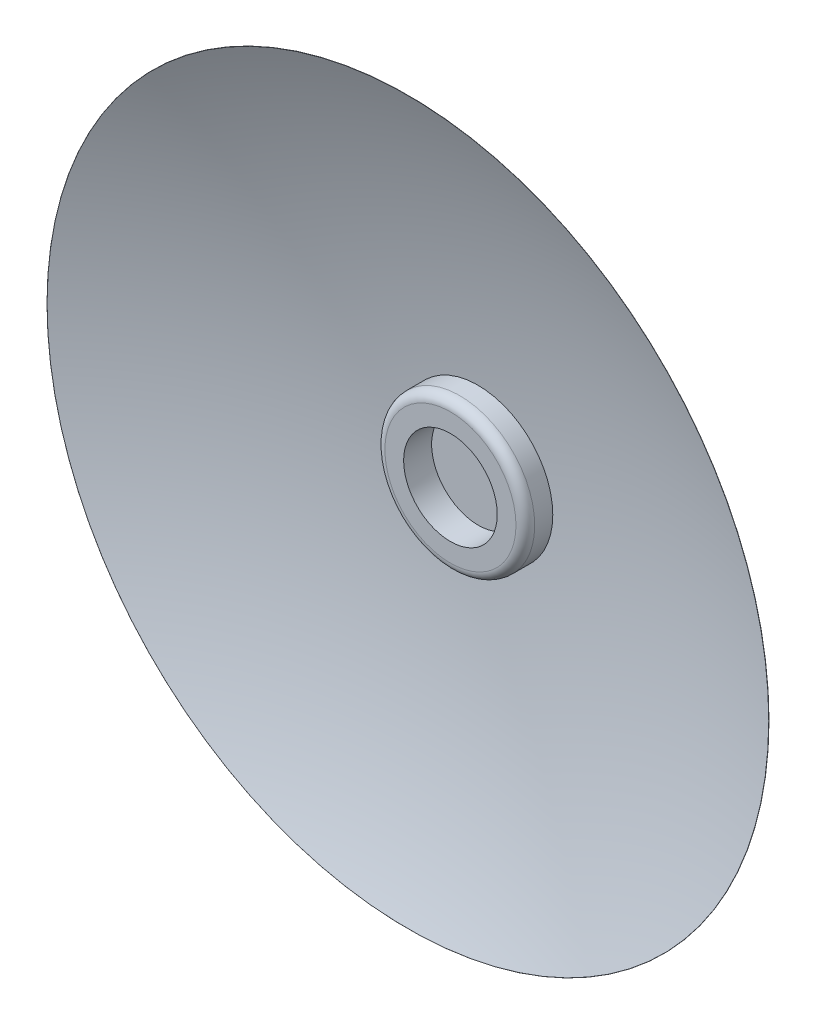
ISO-10303-21;
HEADER;
FILE_DESCRIPTION(('STEP AP214'),'2;1');
FILE_NAME('part.step','',(''),(''),'','','');
FILE_SCHEMA(('AUTOMOTIVE_DESIGN { 1 0 10303 214 1 1 1 1 }'));
ENDSEC;
DATA;
#1=APPLICATION_CONTEXT('core data for automotive mechanical design processes');
#2=APPLICATION_PROTOCOL_DEFINITION('international standard','automotive_design',2000,#1);
#3=PRODUCT_CONTEXT('',#1,'mechanical');
#4=PRODUCT('Part','Part','',(#3));
#5=PRODUCT_RELATED_PRODUCT_CATEGORY('part','',(#4));
#6=PRODUCT_DEFINITION_FORMATION('','',#4);
#7=PRODUCT_DEFINITION_CONTEXT('part definition',#1,'design');
#8=PRODUCT_DEFINITION('design','',#6,#7);
#9=PRODUCT_DEFINITION_SHAPE('','',#8);
#10=(LENGTH_UNIT() NAMED_UNIT(*) SI_UNIT(.MILLI.,.METRE.));
#11=(NAMED_UNIT(*) PLANE_ANGLE_UNIT() SI_UNIT($,.RADIAN.));
#12=(NAMED_UNIT(*) SI_UNIT($,.STERADIAN.) SOLID_ANGLE_UNIT());
#13=UNCERTAINTY_MEASURE_WITH_UNIT(LENGTH_MEASURE(1.E-05),#10,'distance_accuracy_value','');
#14=(GEOMETRIC_REPRESENTATION_CONTEXT(3) GLOBAL_UNCERTAINTY_ASSIGNED_CONTEXT((#13)) GLOBAL_UNIT_ASSIGNED_CONTEXT((#10,
#11,#12)) REPRESENTATION_CONTEXT('',''));
#15=CARTESIAN_POINT('',(0.,0.,0.));
#16=DIRECTION('',(0.,0.,1.));
#17=DIRECTION('',(1.,0.,0.));
#18=AXIS2_PLACEMENT_3D('',#15,#16,#17);
#19=CARTESIAN_POINT('',(0.,0.,-278.231194090801));
#20=DIRECTION('',(0.,0.,1.));
#21=DIRECTION('',(1.,0.,0.));
#22=AXIS2_PLACEMENT_3D('',#19,#20,#21);
#23=CYLINDRICAL_SURFACE('',#22,16.);
#24=CARTESIAN_POINT('',(0.,0.,-348.85065549996));
#25=DIRECTION('',(0.,0.,1.));
#26=DIRECTION('',(1.,0.,0.));
#27=AXIS2_PLACEMENT_3D('',#24,#25,#26);
#28=CIRCLE('',#27,16.);
#29=CARTESIAN_POINT('',(16.,0.,-348.85065549996));
#30=VERTEX_POINT('',#29);
#31=EDGE_CURVE('E50',#30,#30,#28,.T.);
#32=ORIENTED_EDGE('',*,*,#31,.F.);
#33=EDGE_LOOP('',(#32));
#34=FACE_BOUND('',#33,.T.);
#35=CARTESIAN_POINT('',(0.,0.,-352.714702608033));
#36=DIRECTION('',(0.,0.,1.));
#37=DIRECTION('',(1.,0.,0.));
#38=AXIS2_PLACEMENT_3D('',#35,#36,#37);
#39=CIRCLE('',#38,16.);
#40=CARTESIAN_POINT('',(16.,0.,-352.714702608033));
#41=VERTEX_POINT('',#40);
#42=EDGE_CURVE('E69',#41,#41,#39,.T.);
#43=ORIENTED_EDGE('',*,*,#42,.T.);
#44=EDGE_LOOP('',(#43));
#45=FACE_BOUND('',#44,.T.);
#46=ADVANCED_FACE('F41',(#34,#45),#23,.T.);
#47=CARTESIAN_POINT('',(0.,0.,-348.85065549996));
#48=DIRECTION('',(0.,0.,1.));
#49=DIRECTION('',(1.,0.,0.));
#50=AXIS2_PLACEMENT_3D('',#47,#48,#49);
#51=TOROIDAL_SURFACE('',#50,14.,2.);
#52=CARTESIAN_POINT('',(0.,0.,-346.850655499961));
#53=DIRECTION('',(0.,0.,1.));
#54=DIRECTION('',(1.,0.,0.));
#55=AXIS2_PLACEMENT_3D('',#52,#53,#54);
#56=CIRCLE('',#55,14.);
#57=CARTESIAN_POINT('',(14.,0.,-346.850655499961));
#58=VERTEX_POINT('',#57);
#59=EDGE_CURVE('E55',#58,#58,#56,.T.);
#60=ORIENTED_EDGE('',*,*,#59,.F.);
#61=EDGE_LOOP('',(#60));
#62=FACE_BOUND('',#61,.T.);
#63=ORIENTED_EDGE('',*,*,#31,.T.);
#64=EDGE_LOOP('',(#63));
#65=FACE_BOUND('',#64,.T.);
#66=ADVANCED_FACE('F111',(#62,#65),#51,.T.);
#67=CARTESIAN_POINT('',(0.,0.,-346.850655499961));
#68=DIRECTION('',(0.,0.,-1.));
#69=DIRECTION('',(-1.,0.,0.));
#70=AXIS2_PLACEMENT_3D('',#67,#68,#69);
#71=PLANE('',#70);
#72=CARTESIAN_POINT('',(0.,0.,-346.850655499961));
#73=DIRECTION('',(0.,0.,-1.));
#74=DIRECTION('',(-1.,0.,0.));
#75=AXIS2_PLACEMENT_3D('',#72,#73,#74);
#76=CIRCLE('',#75,10.);
#77=CARTESIAN_POINT('',(-10.,0.,-346.850655499961));
#78=VERTEX_POINT('',#77);
#79=EDGE_CURVE('E45',#78,#78,#76,.T.);
#80=ORIENTED_EDGE('',*,*,#79,.T.);
#81=EDGE_LOOP('',(#80));
#82=FACE_BOUND('',#81,.T.);
#83=ORIENTED_EDGE('',*,*,#59,.T.);
#84=EDGE_LOOP('',(#83));
#85=FACE_BOUND('',#84,.T.);
#86=ADVANCED_FACE('F94',(#82,#85),#71,.F.);
#87=CARTESIAN_POINT('',(0.,0.,-163.231194090801));
#88=DIRECTION('',(0.,0.,1.));
#89=DIRECTION('',(1.,0.,0.));
#90=AXIS2_PLACEMENT_3D('',#87,#88,#89);
#91=DEGENERATE_TOROIDAL_SURFACE('',#90,1.99999999999999,190.,.T.);
#92=CARTESIAN_POINT('',(0.,0.,-337.767251372358));
#93=DIRECTION('',(0.,0.,1.));
#94=DIRECTION('',(1.,0.,0.));
#95=AXIS2_PLACEMENT_3D('',#92,#93,#94);
#96=CIRCLE('',#95,77.0810542587733);
#97=CARTESIAN_POINT('',(77.0810542587733,0.,-337.767251372358));
#98=VERTEX_POINT('',#97);
#99=EDGE_CURVE('E81',#98,#98,#96,.T.);
#100=ORIENTED_EDGE('',*,*,#99,.T.);
#101=EDGE_LOOP('',(#100));
#102=FACE_BOUND('',#101,.T.);
#103=ORIENTED_EDGE('',*,*,#42,.F.);
#104=EDGE_LOOP('',(#103));
#105=FACE_BOUND('',#104,.T.);
#106=ADVANCED_FACE('F123',(#102,#105),#91,.F.);
#107=CARTESIAN_POINT('',(0.,0.,-278.231194090801));
#108=DIRECTION('',(0.,0.,1.));
#109=DIRECTION('',(1.,0.,0.));
#110=AXIS2_PLACEMENT_3D('',#107,#108,#109);
#111=CYLINDRICAL_SURFACE('',#110,7.);
#112=CARTESIAN_POINT('',(0.,0.,-354.759388720713));
#113=DIRECTION('',(0.,0.,1.));
#114=DIRECTION('',(1.,0.,0.));
#115=AXIS2_PLACEMENT_3D('',#112,#113,#114);
#116=CIRCLE('',#115,7.);
#117=CARTESIAN_POINT('',(6.99999999999999,0.,-354.759388720713));
#118=VERTEX_POINT('',#117);
#119=EDGE_CURVE('E73',#118,#118,#116,.T.);
#120=ORIENTED_EDGE('',*,*,#119,.F.);
#121=EDGE_LOOP('',(#120));
#122=FACE_BOUND('',#121,.T.);
#123=CARTESIAN_POINT('',(0.,0.,-353.165393223027));
#124=DIRECTION('',(0.,0.,1.));
#125=DIRECTION('',(1.,0.,0.));
#126=AXIS2_PLACEMENT_3D('',#123,#124,#125);
#127=CIRCLE('',#126,7.);
#128=CARTESIAN_POINT('',(6.99999999999999,0.,-353.165393223027));
#129=VERTEX_POINT('',#128);
#130=EDGE_CURVE('E10',#129,#129,#127,.T.);
#131=ORIENTED_EDGE('',*,*,#130,.T.);
#132=EDGE_LOOP('',(#131));
#133=FACE_BOUND('',#132,.T.);
#134=ADVANCED_FACE('F134',(#122,#133),#111,.F.);
#135=CARTESIAN_POINT('',(0.,0.,-180.713603855984));
#136=DIRECTION('',(0.,0.,1.));
#137=DIRECTION('',(1.,0.,0.));
#138=AXIS2_PLACEMENT_3D('',#135,#136,#137);
#139=DEGENERATE_TOROIDAL_SURFACE('',#138,1.99999999999999,174.117590234817,.T.);
#140=ORIENTED_EDGE('',*,*,#119,.T.);
#141=EDGE_LOOP('',(#140));
#142=FACE_BOUND('',#141,.T.);
#143=CARTESIAN_POINT('',(0.,0.,-337.803667723761));
#144=DIRECTION('',(0.,0.,1.));
#145=DIRECTION('',(1.,0.,0.));
#146=AXIS2_PLACEMENT_3D('',#143,#144,#145);
#147=CIRCLE('',#146,77.0975836042502);
#148=CARTESIAN_POINT('',(77.0975836042502,0.,-337.803667723761));
#149=VERTEX_POINT('',#148);
#150=EDGE_CURVE('E77',#149,#149,#147,.T.);
#151=ORIENTED_EDGE('',*,*,#150,.F.);
#152=EDGE_LOOP('',(#151));
#153=FACE_BOUND('',#152,.T.);
#154=ADVANCED_FACE('F138',(#142,#153),#139,.T.);
#155=CARTESIAN_POINT('',(0.,0.,-337.785623588914));
#156=DIRECTION('',(0.,0.,1.));
#157=DIRECTION('',(1.,0.,0.));
#158=AXIS2_PLACEMENT_3D('',#155,#156,#157);
#159=TOROIDAL_SURFACE('',#158,77.0889575276426,0.0199999999999912);
#160=ORIENTED_EDGE('',*,*,#150,.T.);
#161=EDGE_LOOP('',(#160));
#162=FACE_BOUND('',#161,.T.);
#163=ORIENTED_EDGE('',*,*,#99,.F.);
#164=EDGE_LOOP('',(#163));
#165=FACE_BOUND('',#164,.T.);
#166=ADVANCED_FACE('F127',(#162,#165),#159,.T.);
#167=CARTESIAN_POINT('',(0.,0.,-357.831194090801));
#168=DIRECTION('',(0.,0.,1.));
#169=DIRECTION('',(1.,0.,0.));
#170=AXIS2_PLACEMENT_3D('',#167,#168,#169);
#171=PLANE('',#170);
#172=CARTESIAN_POINT('',(0.,0.,-357.831194090801));
#173=DIRECTION('',(0.,0.,1.));
#174=DIRECTION('',(1.,0.,0.));
#175=AXIS2_PLACEMENT_3D('',#172,#173,#174);
#176=CIRCLE('',#175,1.99999999999999);
#177=CARTESIAN_POINT('',(1.99999999999998,0.,-357.831194090801));
#178=VERTEX_POINT('',#177);
#179=EDGE_CURVE('E61',#178,#178,#176,.T.);
#180=ORIENTED_EDGE('',*,*,#179,.F.);
#181=EDGE_LOOP('',(#180));
#182=FACE_BOUND('',#181,.T.);
#183=ADVANCED_FACE('F124',(#182),#171,.F.);
#184=CARTESIAN_POINT('',(0.,0.,-278.231194090801));
#185=DIRECTION('',(0.,0.,1.));
#186=DIRECTION('',(1.,0.,0.));
#187=AXIS2_PLACEMENT_3D('',#184,#185,#186);
#188=CYLINDRICAL_SURFACE('',#187,1.99999999999999);
#189=ORIENTED_EDGE('',*,*,#179,.T.);
#190=EDGE_LOOP('',(#189));
#191=FACE_BOUND('',#190,.T.);
#192=CARTESIAN_POINT('',(0.,0.,-353.231194090801));
#193=DIRECTION('',(0.,0.,1.));
#194=DIRECTION('',(1.,0.,0.));
#195=AXIS2_PLACEMENT_3D('',#192,#193,#194);
#196=CIRCLE('',#195,1.99999999999999);
#197=CARTESIAN_POINT('',(1.99999999999998,0.,-353.231194090801));
#198=VERTEX_POINT('',#197);
#199=EDGE_CURVE('E65',#198,#198,#196,.T.);
#200=ORIENTED_EDGE('',*,*,#199,.F.);
#201=EDGE_LOOP('',(#200));
#202=FACE_BOUND('',#201,.T.);
#203=ADVANCED_FACE('F107',(#191,#202),#188,.T.);
#204=CARTESIAN_POINT('',(0.,0.,-163.231194090801));
#205=DIRECTION('',(0.,0.,1.));
#206=DIRECTION('',(1.,0.,0.));
#207=AXIS2_PLACEMENT_3D('',#204,#205,#206);
#208=DEGENERATE_TOROIDAL_SURFACE('',#207,1.99999999999999,190.,.T.);
#209=ORIENTED_EDGE('',*,*,#199,.T.);
#210=EDGE_LOOP('',(#209));
#211=FACE_BOUND('',#210,.T.);
#212=ORIENTED_EDGE('',*,*,#130,.F.);
#213=EDGE_LOOP('',(#212));
#214=FACE_BOUND('',#213,.T.);
#215=ADVANCED_FACE('F43',(#211,#214),#208,.T.);
#216=CARTESIAN_POINT('',(0.,0.,-352.831194090801));
#217=DIRECTION('',(0.,0.,1.));
#218=DIRECTION('',(1.,0.,0.));
#219=AXIS2_PLACEMENT_3D('',#216,#217,#218);
#220=CYLINDRICAL_SURFACE('',#219,10.);
#221=CARTESIAN_POINT('',(0.,0.,-352.831194090801));
#222=DIRECTION('',(0.,0.,1.));
#223=DIRECTION('',(1.,0.,0.));
#224=AXIS2_PLACEMENT_3D('',#221,#222,#223);
#225=CIRCLE('',#224,10.);
#226=CARTESIAN_POINT('',(10.,0.,-352.831194090801));
#227=VERTEX_POINT('',#226);
#228=EDGE_CURVE('E85',#227,#227,#225,.T.);
#229=ORIENTED_EDGE('',*,*,#228,.F.);
#230=EDGE_LOOP('',(#229));
#231=FACE_BOUND('',#230,.T.);
#232=ORIENTED_EDGE('',*,*,#79,.F.);
#233=EDGE_LOOP('',(#232));
#234=FACE_BOUND('',#233,.T.);
#235=ADVANCED_FACE('F97',(#231,#234),#220,.F.);
#236=CARTESIAN_POINT('',(0.,0.,-352.831194090801));
#237=DIRECTION('',(0.,0.,1.));
#238=DIRECTION('',(1.,0.,0.));
#239=AXIS2_PLACEMENT_3D('',#236,#237,#238);
#240=PLANE('',#239);
#241=ORIENTED_EDGE('',*,*,#228,.T.);
#242=EDGE_LOOP('',(#241));
#243=FACE_BOUND('',#242,.T.);
#244=ADVANCED_FACE('F99',(#243),#240,.T.);
#245=CLOSED_SHELL('',(#46,#66,#86,#106,#134,#154,#166,#183,#203,#215,#235,#244));
#246=MANIFOLD_SOLID_BREP('B2',#245);
#247=ADVANCED_BREP_SHAPE_REPRESENTATION('',(#18,#246),#14);
#248=SHAPE_DEFINITION_REPRESENTATION(#9,#247);
ENDSEC;
END-ISO-10303-21;
